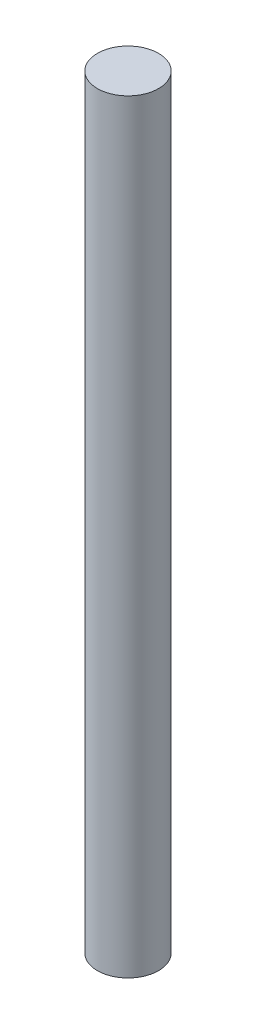
ISO-10303-21;
HEADER;
FILE_DESCRIPTION(('STEP AP214'),'2;1');
FILE_NAME('part.step','',(''),(''),'','','');
FILE_SCHEMA(('AUTOMOTIVE_DESIGN { 1 0 10303 214 1 1 1 1 }'));
ENDSEC;
DATA;
#1=APPLICATION_CONTEXT('core data for automotive mechanical design processes');
#2=APPLICATION_PROTOCOL_DEFINITION('international standard','automotive_design',2000,#1);
#3=PRODUCT_CONTEXT('',#1,'mechanical');
#4=PRODUCT('Part','Part','',(#3));
#5=PRODUCT_RELATED_PRODUCT_CATEGORY('part','',(#4));
#6=PRODUCT_DEFINITION_FORMATION('','',#4);
#7=PRODUCT_DEFINITION_CONTEXT('part definition',#1,'design');
#8=PRODUCT_DEFINITION('design','',#6,#7);
#9=PRODUCT_DEFINITION_SHAPE('','',#8);
#10=(LENGTH_UNIT() NAMED_UNIT(*) SI_UNIT(.MILLI.,.METRE.));
#11=(NAMED_UNIT(*) PLANE_ANGLE_UNIT() SI_UNIT($,.RADIAN.));
#12=(NAMED_UNIT(*) SI_UNIT($,.STERADIAN.) SOLID_ANGLE_UNIT());
#13=UNCERTAINTY_MEASURE_WITH_UNIT(LENGTH_MEASURE(1.E-05),#10,'distance_accuracy_value','');
#14=(GEOMETRIC_REPRESENTATION_CONTEXT(3) GLOBAL_UNCERTAINTY_ASSIGNED_CONTEXT((#13)) GLOBAL_UNIT_ASSIGNED_CONTEXT((#10,
#11,#12)) REPRESENTATION_CONTEXT('',''));
#15=CARTESIAN_POINT('',(0.,0.,0.));
#16=DIRECTION('',(0.,0.,1.));
#17=DIRECTION('',(1.,0.,0.));
#18=AXIS2_PLACEMENT_3D('',#15,#16,#17);
#19=CARTESIAN_POINT('',(0.,75.,0.));
#20=DIRECTION('',(0.,-1.,0.));
#21=DIRECTION('',(0.,0.,-1.));
#22=AXIS2_PLACEMENT_3D('',#19,#20,#21);
#23=CYLINDRICAL_SURFACE('',#22,3.);
#24=CARTESIAN_POINT('',(0.,75.,0.));
#25=DIRECTION('',(0.,1.,0.));
#26=DIRECTION('',(0.,0.,1.));
#27=AXIS2_PLACEMENT_3D('',#24,#25,#26);
#28=CIRCLE('',#27,3.);
#29=CARTESIAN_POINT('',(0.,75.,3.));
#30=VERTEX_POINT('',#29);
#31=EDGE_CURVE('E10',#30,#30,#28,.T.);
#32=ORIENTED_EDGE('',*,*,#31,.F.);
#33=EDGE_LOOP('',(#32));
#34=FACE_BOUND('',#33,.T.);
#35=CARTESIAN_POINT('',(0.,0.,0.));
#36=DIRECTION('',(0.,1.,0.));
#37=DIRECTION('',(0.,0.,1.));
#38=AXIS2_PLACEMENT_3D('',#35,#36,#37);
#39=CIRCLE('',#38,3.);
#40=CARTESIAN_POINT('',(0.,0.,3.));
#41=VERTEX_POINT('',#40);
#42=EDGE_CURVE('E34',#41,#41,#39,.T.);
#43=ORIENTED_EDGE('',*,*,#42,.T.);
#44=EDGE_LOOP('',(#43));
#45=FACE_BOUND('',#44,.T.);
#46=ADVANCED_FACE('F31',(#34,#45),#23,.T.);
#47=CARTESIAN_POINT('',(0.,75.,0.));
#48=DIRECTION('',(0.,1.,0.));
#49=DIRECTION('',(0.,0.,1.));
#50=AXIS2_PLACEMENT_3D('',#47,#48,#49);
#51=PLANE('',#50);
#52=ORIENTED_EDGE('',*,*,#31,.T.);
#53=EDGE_LOOP('',(#52));
#54=FACE_BOUND('',#53,.T.);
#55=ADVANCED_FACE('F46',(#54),#51,.T.);
#56=CARTESIAN_POINT('',(0.,0.,0.));
#57=DIRECTION('',(0.,1.,0.));
#58=DIRECTION('',(0.,0.,1.));
#59=AXIS2_PLACEMENT_3D('',#56,#57,#58);
#60=PLANE('',#59);
#61=ORIENTED_EDGE('',*,*,#42,.F.);
#62=EDGE_LOOP('',(#61));
#63=FACE_BOUND('',#62,.T.);
#64=ADVANCED_FACE('F44',(#63),#60,.F.);
#65=CLOSED_SHELL('',(#46,#55,#64));
#66=MANIFOLD_SOLID_BREP('B2',#65);
#67=ADVANCED_BREP_SHAPE_REPRESENTATION('',(#18,#66),#14);
#68=SHAPE_DEFINITION_REPRESENTATION(#9,#67);
ENDSEC;
END-ISO-10303-21;
